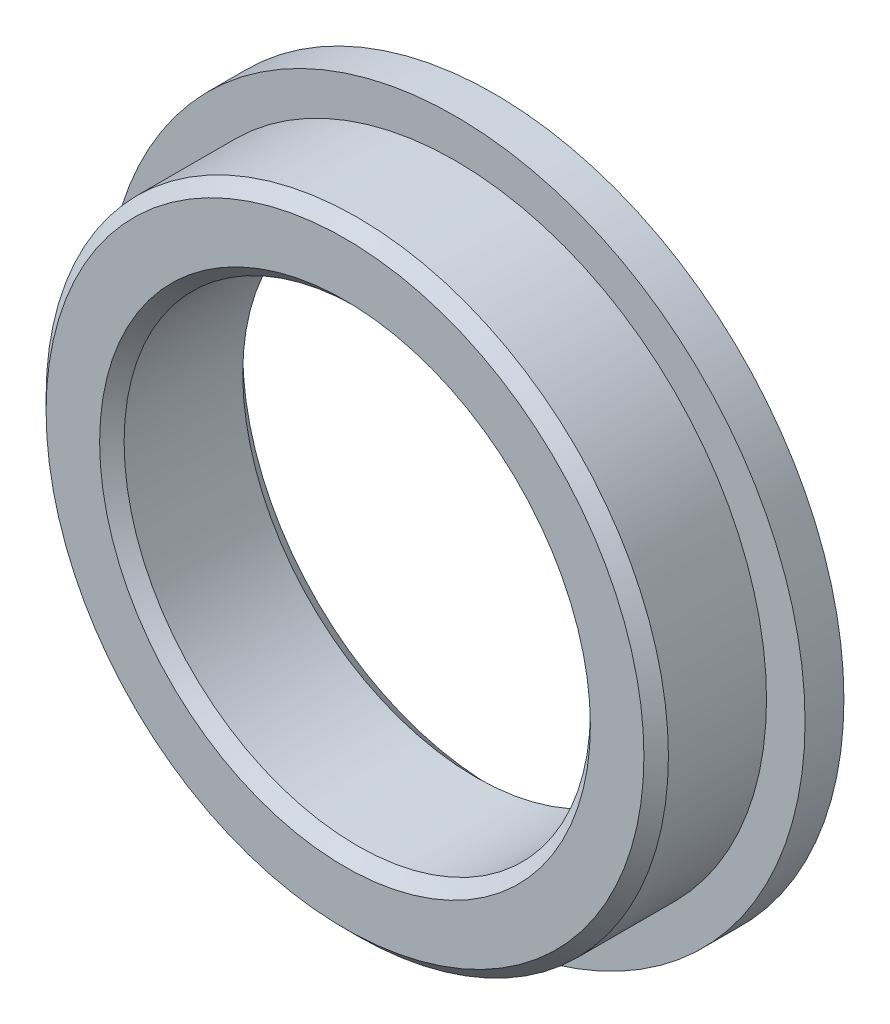
ISO-10303-21;
HEADER;
FILE_DESCRIPTION(('STEP AP214'),'2;1');
FILE_NAME('part.step','',(''),(''),'','','');
FILE_SCHEMA(('AUTOMOTIVE_DESIGN { 1 0 10303 214 1 1 1 1 }'));
ENDSEC;
DATA;
#1=APPLICATION_CONTEXT('core data for automotive mechanical design processes');
#2=APPLICATION_PROTOCOL_DEFINITION('international standard','automotive_design',2000,#1);
#3=PRODUCT_CONTEXT('',#1,'mechanical');
#4=PRODUCT('Part','Part','',(#3));
#5=PRODUCT_RELATED_PRODUCT_CATEGORY('part','',(#4));
#6=PRODUCT_DEFINITION_FORMATION('','',#4);
#7=PRODUCT_DEFINITION_CONTEXT('part definition',#1,'design');
#8=PRODUCT_DEFINITION('design','',#6,#7);
#9=PRODUCT_DEFINITION_SHAPE('','',#8);
#10=(LENGTH_UNIT() NAMED_UNIT(*) SI_UNIT(.MILLI.,.METRE.));
#11=(NAMED_UNIT(*) PLANE_ANGLE_UNIT() SI_UNIT($,.RADIAN.));
#12=(NAMED_UNIT(*) SI_UNIT($,.STERADIAN.) SOLID_ANGLE_UNIT());
#13=UNCERTAINTY_MEASURE_WITH_UNIT(LENGTH_MEASURE(1.E-05),#10,'distance_accuracy_value','');
#14=(GEOMETRIC_REPRESENTATION_CONTEXT(3) GLOBAL_UNCERTAINTY_ASSIGNED_CONTEXT((#13)) GLOBAL_UNIT_ASSIGNED_CONTEXT((#10,
#11,#12)) REPRESENTATION_CONTEXT('',''));
#15=CARTESIAN_POINT('',(0.,0.,0.));
#16=DIRECTION('',(0.,0.,1.));
#17=DIRECTION('',(1.,0.,0.));
#18=AXIS2_PLACEMENT_3D('',#15,#16,#17);
#19=CARTESIAN_POINT('',(0.,9.525,3.048));
#20=DIRECTION('',(0.,0.,-1.));
#21=DIRECTION('',(-1.,0.,0.));
#22=AXIS2_PLACEMENT_3D('',#19,#20,#21);
#23=PLANE('',#22);
#24=CARTESIAN_POINT('',(0.,0.,3.048));
#25=DIRECTION('',(0.,0.,-1.));
#26=DIRECTION('',(-1.,0.,0.));
#27=AXIS2_PLACEMENT_3D('',#24,#25,#26);
#28=CIRCLE('',#27,12.2127);
#29=CARTESIAN_POINT('',(-12.2127,0.,3.048));
#30=VERTEX_POINT('',#29);
#31=EDGE_CURVE('E18',#30,#30,#28,.T.);
#32=ORIENTED_EDGE('',*,*,#31,.F.);
#33=EDGE_LOOP('',(#32));
#34=FACE_BOUND('',#33,.T.);
#35=CARTESIAN_POINT('',(0.,0.,3.048));
#36=DIRECTION('',(0.,0.,1.));
#37=DIRECTION('',(1.,0.,0.));
#38=AXIS2_PLACEMENT_3D('',#35,#36,#37);
#39=CIRCLE('',#38,10.025);
#40=CARTESIAN_POINT('',(10.025,0.,3.048));
#41=VERTEX_POINT('',#40);
#42=EDGE_CURVE('E39',#41,#41,#39,.F.);
#43=ORIENTED_EDGE('',*,*,#42,.T.);
#44=EDGE_LOOP('',(#43));
#45=FACE_BOUND('',#44,.T.);
#46=ADVANCED_FACE('F15',(#34,#45),#23,.F.);
#47=CARTESIAN_POINT('',(0.,0.,2.548));
#48=DIRECTION('',(0.,0.,-1.));
#49=DIRECTION('',(-1.,0.,0.));
#50=AXIS2_PLACEMENT_3D('',#47,#48,#49);
#51=CONICAL_SURFACE('',#50,12.7127,0.785398163397447);
#52=CARTESIAN_POINT('',(0.,0.,2.548));
#53=DIRECTION('',(0.,0.,1.));
#54=DIRECTION('',(1.,0.,0.));
#55=AXIS2_PLACEMENT_3D('',#52,#53,#54);
#56=CIRCLE('',#55,12.7127);
#57=CARTESIAN_POINT('',(12.7127,0.,2.548));
#58=VERTEX_POINT('',#57);
#59=EDGE_CURVE('E30',#58,#58,#56,.F.);
#60=ORIENTED_EDGE('',*,*,#59,.F.);
#61=EDGE_LOOP('',(#60));
#62=FACE_BOUND('',#61,.T.);
#63=ORIENTED_EDGE('',*,*,#31,.T.);
#64=EDGE_LOOP('',(#63));
#65=FACE_BOUND('',#64,.T.);
#66=ADVANCED_FACE('F47',(#62,#65),#51,.T.);
#67=CARTESIAN_POINT('',(0.,0.,3.048));
#68=DIRECTION('',(0.,0.,1.));
#69=DIRECTION('',(1.,0.,0.));
#70=AXIS2_PLACEMENT_3D('',#67,#68,#69);
#71=CONICAL_SURFACE('',#70,10.025,0.785398163397446);
#72=ORIENTED_EDGE('',*,*,#42,.F.);
#73=EDGE_LOOP('',(#72));
#74=FACE_BOUND('',#73,.T.);
#75=CARTESIAN_POINT('',(0.,0.,2.54799999999999));
#76=DIRECTION('',(0.,0.,1.));
#77=DIRECTION('',(1.,0.,0.));
#78=AXIS2_PLACEMENT_3D('',#75,#76,#77);
#79=CIRCLE('',#78,9.525);
#80=CARTESIAN_POINT('',(9.525,0.,2.54799999999999));
#81=VERTEX_POINT('',#80);
#82=EDGE_CURVE('E38',#81,#81,#79,.F.);
#83=ORIENTED_EDGE('',*,*,#82,.T.);
#84=EDGE_LOOP('',(#83));
#85=FACE_BOUND('',#84,.T.);
#86=ADVANCED_FACE('F54',(#74,#85),#71,.F.);
#87=CARTESIAN_POINT('',(0.,0.,4.09575));
#88=DIRECTION('',(0.,0.,1.));
#89=DIRECTION('',(1.,0.,0.));
#90=AXIS2_PLACEMENT_3D('',#87,#88,#89);
#91=CYLINDRICAL_SURFACE('',#90,12.7127);
#92=ORIENTED_EDGE('',*,*,#59,.T.);
#93=EDGE_LOOP('',(#92));
#94=FACE_BOUND('',#93,.T.);
#95=CARTESIAN_POINT('',(0.,0.,-1.4605));
#96=DIRECTION('',(0.,0.,1.));
#97=DIRECTION('',(1.,0.,0.));
#98=AXIS2_PLACEMENT_3D('',#95,#96,#97);
#99=CIRCLE('',#98,12.7127);
#100=CARTESIAN_POINT('',(12.7127,0.,-1.4605));
#101=VERTEX_POINT('',#100);
#102=EDGE_CURVE('E36',#101,#101,#99,.T.);
#103=ORIENTED_EDGE('',*,*,#102,.T.);
#104=EDGE_LOOP('',(#103));
#105=FACE_BOUND('',#104,.T.);
#106=ADVANCED_FACE('F79',(#94,#105),#91,.T.);
#107=CARTESIAN_POINT('',(0.,0.,4.09575));
#108=DIRECTION('',(0.,0.,1.));
#109=DIRECTION('',(1.,0.,0.));
#110=AXIS2_PLACEMENT_3D('',#107,#108,#109);
#111=CYLINDRICAL_SURFACE('',#110,9.525);
#112=ORIENTED_EDGE('',*,*,#82,.F.);
#113=EDGE_LOOP('',(#112));
#114=FACE_BOUND('',#113,.T.);
#115=CARTESIAN_POINT('',(0.,0.,-2.298));
#116=DIRECTION('',(0.,0.,-1.));
#117=DIRECTION('',(-1.,0.,0.));
#118=AXIS2_PLACEMENT_3D('',#115,#116,#117);
#119=CIRCLE('',#118,9.525);
#120=CARTESIAN_POINT('',(-9.525,0.,-2.298));
#121=VERTEX_POINT('',#120);
#122=EDGE_CURVE('E35',#121,#121,#119,.T.);
#123=ORIENTED_EDGE('',*,*,#122,.T.);
#124=EDGE_LOOP('',(#123));
#125=FACE_BOUND('',#124,.T.);
#126=ADVANCED_FACE('F75',(#114,#125),#111,.F.);
#127=CARTESIAN_POINT('',(0.,12.7127,-1.4605));
#128=DIRECTION('',(0.,0.,-1.));
#129=DIRECTION('',(-1.,0.,0.));
#130=AXIS2_PLACEMENT_3D('',#127,#128,#129);
#131=PLANE('',#130);
#132=CARTESIAN_POINT('',(0.,0.,-1.4605));
#133=DIRECTION('',(0.,0.,1.));
#134=DIRECTION('',(1.,0.,0.));
#135=AXIS2_PLACEMENT_3D('',#132,#133,#134);
#136=CIRCLE('',#135,14.2875);
#137=CARTESIAN_POINT('',(14.2875,0.,-1.4605));
#138=VERTEX_POINT('',#137);
#139=EDGE_CURVE('E27',#138,#138,#136,.F.);
#140=ORIENTED_EDGE('',*,*,#139,.F.);
#141=EDGE_LOOP('',(#140));
#142=FACE_BOUND('',#141,.T.);
#143=ORIENTED_EDGE('',*,*,#102,.F.);
#144=EDGE_LOOP('',(#143));
#145=FACE_BOUND('',#144,.T.);
#146=ADVANCED_FACE('F71',(#142,#145),#131,.F.);
#147=CARTESIAN_POINT('',(0.,0.,-3.048));
#148=DIRECTION('',(0.,0.,-1.));
#149=DIRECTION('',(-1.,0.,0.));
#150=AXIS2_PLACEMENT_3D('',#147,#148,#149);
#151=CONICAL_SURFACE('',#150,10.275,0.785398163397446);
#152=CARTESIAN_POINT('',(0.,0.,-3.048));
#153=DIRECTION('',(0.,0.,-1.));
#154=DIRECTION('',(-1.,0.,0.));
#155=AXIS2_PLACEMENT_3D('',#152,#153,#154);
#156=CIRCLE('',#155,10.275);
#157=CARTESIAN_POINT('',(-10.275,0.,-3.048));
#158=VERTEX_POINT('',#157);
#159=EDGE_CURVE('E22',#158,#158,#156,.T.);
#160=ORIENTED_EDGE('',*,*,#159,.T.);
#161=EDGE_LOOP('',(#160));
#162=FACE_BOUND('',#161,.T.);
#163=ORIENTED_EDGE('',*,*,#122,.F.);
#164=EDGE_LOOP('',(#163));
#165=FACE_BOUND('',#164,.T.);
#166=ADVANCED_FACE('F64',(#162,#165),#151,.F.);
#167=CARTESIAN_POINT('',(0.,0.,4.09575));
#168=DIRECTION('',(0.,0.,1.));
#169=DIRECTION('',(1.,0.,0.));
#170=AXIS2_PLACEMENT_3D('',#167,#168,#169);
#171=CYLINDRICAL_SURFACE('',#170,14.2875);
#172=ORIENTED_EDGE('',*,*,#139,.T.);
#173=EDGE_LOOP('',(#172));
#174=FACE_BOUND('',#173,.T.);
#175=CARTESIAN_POINT('',(0.,0.,-3.048));
#176=DIRECTION('',(0.,0.,1.));
#177=DIRECTION('',(1.,0.,0.));
#178=AXIS2_PLACEMENT_3D('',#175,#176,#177);
#179=CIRCLE('',#178,14.2875);
#180=CARTESIAN_POINT('',(14.2875,0.,-3.048));
#181=VERTEX_POINT('',#180);
#182=EDGE_CURVE('E10',#181,#181,#179,.T.);
#183=ORIENTED_EDGE('',*,*,#182,.T.);
#184=EDGE_LOOP('',(#183));
#185=FACE_BOUND('',#184,.T.);
#186=ADVANCED_FACE('F58',(#174,#185),#171,.T.);
#187=CARTESIAN_POINT('',(0.,14.2875,-3.048));
#188=DIRECTION('',(0.,0.,1.));
#189=DIRECTION('',(1.,0.,0.));
#190=AXIS2_PLACEMENT_3D('',#187,#188,#189);
#191=PLANE('',#190);
#192=ORIENTED_EDGE('',*,*,#182,.F.);
#193=EDGE_LOOP('',(#192));
#194=FACE_BOUND('',#193,.T.);
#195=ORIENTED_EDGE('',*,*,#159,.F.);
#196=EDGE_LOOP('',(#195));
#197=FACE_BOUND('',#196,.T.);
#198=ADVANCED_FACE('F56',(#194,#197),#191,.F.);
#199=CLOSED_SHELL('',(#46,#66,#86,#106,#126,#146,#166,#186,#198));
#200=MANIFOLD_SOLID_BREP('B1',#199);
#201=ADVANCED_BREP_SHAPE_REPRESENTATION('',(#18,#200),#14);
#202=SHAPE_DEFINITION_REPRESENTATION(#9,#201);
ENDSEC;
END-ISO-10303-21;
